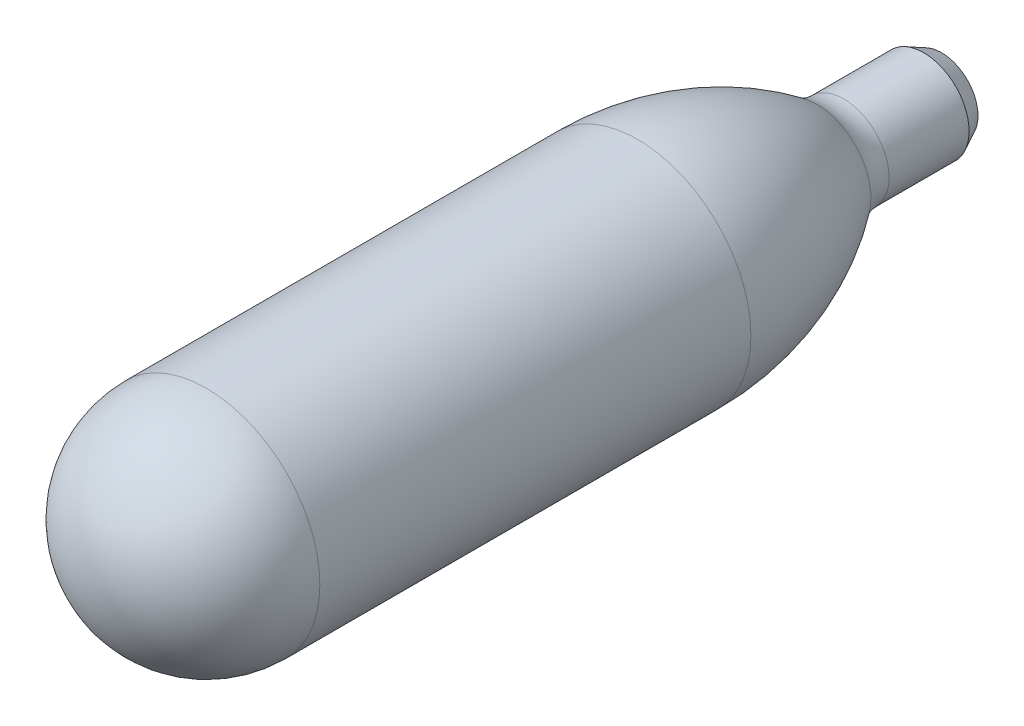
ISO-10303-21;
HEADER;
FILE_DESCRIPTION(('STEP AP214'),'2;1');
FILE_NAME('part.step','',(''),(''),'','','');
FILE_SCHEMA(('AUTOMOTIVE_DESIGN { 1 0 10303 214 1 1 1 1 }'));
ENDSEC;
DATA;
#1=APPLICATION_CONTEXT('core data for automotive mechanical design processes');
#2=APPLICATION_PROTOCOL_DEFINITION('international standard','automotive_design',2000,#1);
#3=PRODUCT_CONTEXT('',#1,'mechanical');
#4=PRODUCT('Part','Part','',(#3));
#5=PRODUCT_RELATED_PRODUCT_CATEGORY('part','',(#4));
#6=PRODUCT_DEFINITION_FORMATION('','',#4);
#7=PRODUCT_DEFINITION_CONTEXT('part definition',#1,'design');
#8=PRODUCT_DEFINITION('design','',#6,#7);
#9=PRODUCT_DEFINITION_SHAPE('','',#8);
#10=(LENGTH_UNIT() NAMED_UNIT(*) SI_UNIT(.MILLI.,.METRE.));
#11=(NAMED_UNIT(*) PLANE_ANGLE_UNIT() SI_UNIT($,.RADIAN.));
#12=(NAMED_UNIT(*) SI_UNIT($,.STERADIAN.) SOLID_ANGLE_UNIT());
#13=UNCERTAINTY_MEASURE_WITH_UNIT(LENGTH_MEASURE(1.E-05),#10,'distance_accuracy_value','');
#14=(GEOMETRIC_REPRESENTATION_CONTEXT(3) GLOBAL_UNCERTAINTY_ASSIGNED_CONTEXT((#13)) GLOBAL_UNIT_ASSIGNED_CONTEXT((#10,
#11,#12)) REPRESENTATION_CONTEXT('',''));
#15=CARTESIAN_POINT('',(0.,0.,0.));
#16=DIRECTION('',(0.,0.,1.));
#17=DIRECTION('',(1.,0.,0.));
#18=AXIS2_PLACEMENT_3D('',#15,#16,#17);
#19=CARTESIAN_POINT('',(0.,0.,-12.7));
#20=DIRECTION('',(0.,0.,1.));
#21=DIRECTION('',(0.,1.,0.));
#22=AXIS2_PLACEMENT_3D('',#19,#20,#21);
#23=SPHERICAL_SURFACE('',#22,11.45);
#24=CARTESIAN_POINT('',(0.,0.,-12.7));
#25=DIRECTION('',(0.,0.,1.));
#26=DIRECTION('',(1.,0.,0.));
#27=AXIS2_PLACEMENT_3D('',#24,#25,#26);
#28=CIRCLE('',#27,11.45);
#29=CARTESIAN_POINT('',(11.45,0.,-12.7));
#30=VERTEX_POINT('',#29);
#31=EDGE_CURVE('E54',#30,#30,#28,.T.);
#32=ORIENTED_EDGE('',*,*,#31,.F.);
#33=EDGE_LOOP('',(#32));
#34=FACE_BOUND('',#33,.T.);
#35=ADVANCED_FACE('F31',(#34),#23,.F.);
#36=CARTESIAN_POINT('',(0.,0.,0.));
#37=DIRECTION('',(0.,0.,1.));
#38=DIRECTION('',(1.,0.,0.));
#39=AXIS2_PLACEMENT_3D('',#36,#37,#38);
#40=CYLINDRICAL_SURFACE('',#39,11.45);
#41=ORIENTED_EDGE('',*,*,#31,.T.);
#42=EDGE_LOOP('',(#41));
#43=FACE_BOUND('',#42,.T.);
#44=CARTESIAN_POINT('',(0.,0.,-60.96));
#45=DIRECTION('',(0.,0.,1.));
#46=DIRECTION('',(1.,0.,0.));
#47=AXIS2_PLACEMENT_3D('',#44,#45,#46);
#48=CIRCLE('',#47,11.45);
#49=CARTESIAN_POINT('',(11.45,0.,-60.96));
#50=VERTEX_POINT('',#49);
#51=EDGE_CURVE('E52',#50,#50,#48,.T.);
#52=ORIENTED_EDGE('',*,*,#51,.F.);
#53=EDGE_LOOP('',(#52));
#54=FACE_BOUND('',#53,.T.);
#55=ADVANCED_FACE('F100',(#43,#54),#40,.F.);
#56=CARTESIAN_POINT('',(0.,0.,-60.96));
#57=DIRECTION('',(0.,0.,1.));
#58=DIRECTION('',(1.,0.,0.));
#59=AXIS2_PLACEMENT_3D('',#56,#57,#58);
#60=DEGENERATE_TOROIDAL_SURFACE('',#59,20.9916010498688,32.4416010498688,.F.);
#61=ORIENTED_EDGE('',*,*,#51,.T.);
#62=EDGE_LOOP('',(#61));
#63=FACE_BOUND('',#62,.T.);
#64=CARTESIAN_POINT('',(0.,0.,-80.2741982022501));
#65=DIRECTION('',(0.,0.,1.));
#66=DIRECTION('',(1.,0.,0.));
#67=AXIS2_PLACEMENT_3D('',#64,#65,#66);
#68=CIRCLE('',#67,5.07407036835955);
#69=CARTESIAN_POINT('',(5.07407036835955,0.,-80.2741982022501));
#70=VERTEX_POINT('',#69);
#71=EDGE_CURVE('E44',#70,#70,#68,.T.);
#72=ORIENTED_EDGE('',*,*,#71,.F.);
#73=EDGE_LOOP('',(#72));
#74=FACE_BOUND('',#73,.T.);
#75=ADVANCED_FACE('F106',(#63,#74),#60,.T.);
#76=CARTESIAN_POINT('',(0.,0.,-84.0427814615137));
#77=DIRECTION('',(0.,0.,1.));
#78=DIRECTION('',(1.,0.,0.));
#79=AXIS2_PLACEMENT_3D('',#76,#77,#78);
#80=TOROIDAL_SURFACE('',#79,10.16,6.33);
#81=ORIENTED_EDGE('',*,*,#71,.T.);
#82=EDGE_LOOP('',(#81));
#83=FACE_BOUND('',#82,.T.);
#84=CARTESIAN_POINT('',(0.,0.,-84.0427814615137));
#85=DIRECTION('',(0.,0.,1.));
#86=DIRECTION('',(1.,0.,0.));
#87=AXIS2_PLACEMENT_3D('',#84,#85,#86);
#88=CIRCLE('',#87,3.83);
#89=CARTESIAN_POINT('',(3.83,0.,-84.0427814615137));
#90=VERTEX_POINT('',#89);
#91=EDGE_CURVE('E39',#90,#90,#88,.T.);
#92=ORIENTED_EDGE('',*,*,#91,.F.);
#93=EDGE_LOOP('',(#92));
#94=FACE_BOUND('',#93,.T.);
#95=ADVANCED_FACE('F113',(#83,#94),#80,.T.);
#96=CARTESIAN_POINT('',(0.,0.,0.));
#97=DIRECTION('',(0.,0.,1.));
#98=DIRECTION('',(1.,0.,0.));
#99=AXIS2_PLACEMENT_3D('',#96,#97,#98);
#100=CYLINDRICAL_SURFACE('',#99,3.83);
#101=CARTESIAN_POINT('',(0.,0.,-92.7049150281252));
#102=DIRECTION('',(0.,0.,1.));
#103=DIRECTION('',(1.,0.,0.));
#104=AXIS2_PLACEMENT_3D('',#101,#102,#103);
#105=CIRCLE('',#104,3.83);
#106=CARTESIAN_POINT('',(3.83,0.,-92.7049150281252));
#107=VERTEX_POINT('',#106);
#108=EDGE_CURVE('E10',#107,#107,#105,.T.);
#109=ORIENTED_EDGE('',*,*,#108,.F.);
#110=EDGE_LOOP('',(#109));
#111=FACE_BOUND('',#110,.T.);
#112=ORIENTED_EDGE('',*,*,#91,.T.);
#113=EDGE_LOOP('',(#112));
#114=FACE_BOUND('',#113,.T.);
#115=ADVANCED_FACE('F97',(#111,#114),#100,.F.);
#116=CARTESIAN_POINT('',(0.,0.,-92.440983005625));
#117=DIRECTION('',(0.,0.,1.));
#118=DIRECTION('',(1.,0.,0.));
#119=AXIS2_PLACEMENT_3D('',#116,#117,#118);
#120=CONICAL_SURFACE('',#119,3.9619660112501,0.463647609000805);
#121=CARTESIAN_POINT('',(0.,0.,-93.7289150281252));
#122=DIRECTION('',(0.,0.,1.));
#123=DIRECTION('',(1.,0.,0.));
#124=AXIS2_PLACEMENT_3D('',#121,#122,#123);
#125=CIRCLE('',#124,3.318);
#126=CARTESIAN_POINT('',(3.318,0.,-93.7289150281252));
#127=VERTEX_POINT('',#126);
#128=EDGE_CURVE('E35',#127,#127,#125,.F.);
#129=ORIENTED_EDGE('',*,*,#128,.T.);
#130=EDGE_LOOP('',(#129));
#131=FACE_BOUND('',#130,.T.);
#132=ORIENTED_EDGE('',*,*,#108,.T.);
#133=EDGE_LOOP('',(#132));
#134=FACE_BOUND('',#133,.T.);
#135=ADVANCED_FACE('F33',(#131,#134),#120,.F.);
#136=CARTESIAN_POINT('',(0.,0.,-92.46));
#137=DIRECTION('',(0.,0.,-1.));
#138=DIRECTION('',(-1.,0.,0.));
#139=AXIS2_PLACEMENT_3D('',#136,#137,#138);
#140=CYLINDRICAL_SURFACE('',#139,3.318);
#141=CARTESIAN_POINT('',(0.,0.,-95.));
#142=DIRECTION('',(0.,0.,-1.));
#143=DIRECTION('',(-1.,0.,0.));
#144=AXIS2_PLACEMENT_3D('',#141,#142,#143);
#145=CIRCLE('',#144,3.318);
#146=CARTESIAN_POINT('',(-3.318,0.,-95.));
#147=VERTEX_POINT('',#146);
#148=EDGE_CURVE('E78',#147,#147,#145,.T.);
#149=ORIENTED_EDGE('',*,*,#148,.T.);
#150=EDGE_LOOP('',(#149));
#151=FACE_BOUND('',#150,.T.);
#152=ORIENTED_EDGE('',*,*,#128,.F.);
#153=EDGE_LOOP('',(#152));
#154=FACE_BOUND('',#153,.T.);
#155=ADVANCED_FACE('F86',(#151,#154),#140,.F.);
#156=CARTESIAN_POINT('',(0.,0.,-12.7));
#157=DIRECTION('',(0.,0.,1.));
#158=DIRECTION('',(0.,1.,0.));
#159=AXIS2_PLACEMENT_3D('',#156,#157,#158);
#160=SPHERICAL_SURFACE('',#159,12.7);
#161=CARTESIAN_POINT('',(0.,0.,-12.7));
#162=DIRECTION('',(0.,0.,1.));
#163=DIRECTION('',(1.,0.,0.));
#164=AXIS2_PLACEMENT_3D('',#161,#162,#163);
#165=CIRCLE('',#164,12.7);
#166=CARTESIAN_POINT('',(12.7,0.,-12.7));
#167=VERTEX_POINT('',#166);
#168=EDGE_CURVE('E63',#167,#167,#165,.T.);
#169=ORIENTED_EDGE('',*,*,#168,.T.);
#170=EDGE_LOOP('',(#169));
#171=FACE_BOUND('',#170,.T.);
#172=ADVANCED_FACE('F88',(#171),#160,.T.);
#173=CARTESIAN_POINT('',(0.,0.,0.));
#174=DIRECTION('',(0.,0.,1.));
#175=DIRECTION('',(1.,0.,0.));
#176=AXIS2_PLACEMENT_3D('',#173,#174,#175);
#177=CYLINDRICAL_SURFACE('',#176,12.7);
#178=ORIENTED_EDGE('',*,*,#168,.F.);
#179=EDGE_LOOP('',(#178));
#180=FACE_BOUND('',#179,.T.);
#181=CARTESIAN_POINT('',(0.,0.,-60.96));
#182=DIRECTION('',(0.,0.,1.));
#183=DIRECTION('',(1.,0.,0.));
#184=AXIS2_PLACEMENT_3D('',#181,#182,#183);
#185=CIRCLE('',#184,12.7);
#186=CARTESIAN_POINT('',(12.7,0.,-60.96));
#187=VERTEX_POINT('',#186);
#188=EDGE_CURVE('E67',#187,#187,#185,.T.);
#189=ORIENTED_EDGE('',*,*,#188,.T.);
#190=EDGE_LOOP('',(#189));
#191=FACE_BOUND('',#190,.T.);
#192=ADVANCED_FACE('F94',(#180,#191),#177,.T.);
#193=CARTESIAN_POINT('',(0.,0.,-60.96));
#194=DIRECTION('',(0.,0.,1.));
#195=DIRECTION('',(1.,0.,0.));
#196=AXIS2_PLACEMENT_3D('',#193,#194,#195);
#197=DEGENERATE_TOROIDAL_SURFACE('',#196,20.9916010498688,33.6916010498688,.F.);
#198=ORIENTED_EDGE('',*,*,#188,.F.);
#199=EDGE_LOOP('',(#198));
#200=FACE_BOUND('',#199,.T.);
#201=CARTESIAN_POINT('',(0.,0.,-81.0183892092137));
#202=DIRECTION('',(0.,0.,1.));
#203=DIRECTION('',(1.,0.,0.));
#204=AXIS2_PLACEMENT_3D('',#201,#202,#203);
#205=CIRCLE('',#204,6.0784008643391);
#206=CARTESIAN_POINT('',(6.0784008643391,0.,-81.0183892092137));
#207=VERTEX_POINT('',#206);
#208=EDGE_CURVE('E72',#207,#207,#205,.T.);
#209=ORIENTED_EDGE('',*,*,#208,.T.);
#210=EDGE_LOOP('',(#209));
#211=FACE_BOUND('',#210,.T.);
#212=ADVANCED_FACE('F192',(#200,#211),#197,.F.);
#213=CARTESIAN_POINT('',(0.,0.,-84.0427814615137));
#214=DIRECTION('',(0.,0.,1.));
#215=DIRECTION('',(1.,0.,0.));
#216=AXIS2_PLACEMENT_3D('',#213,#214,#215);
#217=TOROIDAL_SURFACE('',#216,10.16,5.08);
#218=ORIENTED_EDGE('',*,*,#208,.F.);
#219=EDGE_LOOP('',(#218));
#220=FACE_BOUND('',#219,.T.);
#221=CARTESIAN_POINT('',(0.,0.,-84.0427814615137));
#222=DIRECTION('',(0.,0.,1.));
#223=DIRECTION('',(1.,0.,0.));
#224=AXIS2_PLACEMENT_3D('',#221,#222,#223);
#225=CIRCLE('',#224,5.08);
#226=CARTESIAN_POINT('',(5.08,0.,-84.0427814615137));
#227=VERTEX_POINT('',#226);
#228=EDGE_CURVE('E75',#227,#227,#225,.T.);
#229=ORIENTED_EDGE('',*,*,#228,.T.);
#230=EDGE_LOOP('',(#229));
#231=FACE_BOUND('',#230,.T.);
#232=ADVANCED_FACE('F185',(#220,#231),#217,.F.);
#233=CARTESIAN_POINT('',(0.,0.,0.));
#234=DIRECTION('',(0.,0.,1.));
#235=DIRECTION('',(1.,0.,0.));
#236=AXIS2_PLACEMENT_3D('',#233,#234,#235);
#237=CYLINDRICAL_SURFACE('',#236,5.08);
#238=CARTESIAN_POINT('',(0.,0.,-92.9999999999999));
#239=DIRECTION('',(0.,0.,1.));
#240=DIRECTION('',(1.,0.,0.));
#241=AXIS2_PLACEMENT_3D('',#238,#239,#240);
#242=CIRCLE('',#241,5.08);
#243=CARTESIAN_POINT('',(5.08,0.,-92.9999999999999));
#244=VERTEX_POINT('',#243);
#245=EDGE_CURVE('E59',#244,#244,#242,.T.);
#246=ORIENTED_EDGE('',*,*,#245,.T.);
#247=EDGE_LOOP('',(#246));
#248=FACE_BOUND('',#247,.T.);
#249=ORIENTED_EDGE('',*,*,#228,.F.);
#250=EDGE_LOOP('',(#249));
#251=FACE_BOUND('',#250,.T.);
#252=ADVANCED_FACE('F143',(#248,#251),#237,.T.);
#253=CARTESIAN_POINT('',(0.,0.,-95.));
#254=DIRECTION('',(0.,0.,1.));
#255=DIRECTION('',(1.,0.,0.));
#256=AXIS2_PLACEMENT_3D('',#253,#254,#255);
#257=PLANE('',#256);
#258=ORIENTED_EDGE('',*,*,#148,.F.);
#259=EDGE_LOOP('',(#258));
#260=FACE_BOUND('',#259,.T.);
#261=CARTESIAN_POINT('',(0.,0.,-95.));
#262=DIRECTION('',(0.,0.,1.));
#263=DIRECTION('',(1.,0.,0.));
#264=AXIS2_PLACEMENT_3D('',#261,#262,#263);
#265=CIRCLE('',#264,4.07999999999997);
#266=CARTESIAN_POINT('',(4.07999999999997,0.,-95.));
#267=VERTEX_POINT('',#266);
#268=EDGE_CURVE('E47',#267,#267,#265,.F.);
#269=ORIENTED_EDGE('',*,*,#268,.T.);
#270=EDGE_LOOP('',(#269));
#271=FACE_BOUND('',#270,.T.);
#272=ADVANCED_FACE('F139',(#260,#271),#257,.F.);
#273=CARTESIAN_POINT('',(0.,0.,-92.9999999999999));
#274=DIRECTION('',(0.,0.,1.));
#275=DIRECTION('',(1.,0.,0.));
#276=AXIS2_PLACEMENT_3D('',#273,#274,#275);
#277=CONICAL_SURFACE('',#276,5.08,0.463647609000805);
#278=ORIENTED_EDGE('',*,*,#268,.F.);
#279=EDGE_LOOP('',(#278));
#280=FACE_BOUND('',#279,.T.);
#281=ORIENTED_EDGE('',*,*,#245,.F.);
#282=EDGE_LOOP('',(#281));
#283=FACE_BOUND('',#282,.T.);
#284=ADVANCED_FACE('F109',(#280,#283),#277,.T.);
#285=CLOSED_SHELL('',(#35,#55,#75,#95,#115,#135,#155,#172,#192,#212,#232,#252,#272,#284));
#286=MANIFOLD_SOLID_BREP('B2',#285);
#287=ADVANCED_BREP_SHAPE_REPRESENTATION('',(#18,#286),#14);
#288=SHAPE_DEFINITION_REPRESENTATION(#9,#287);
ENDSEC;
END-ISO-10303-21;
